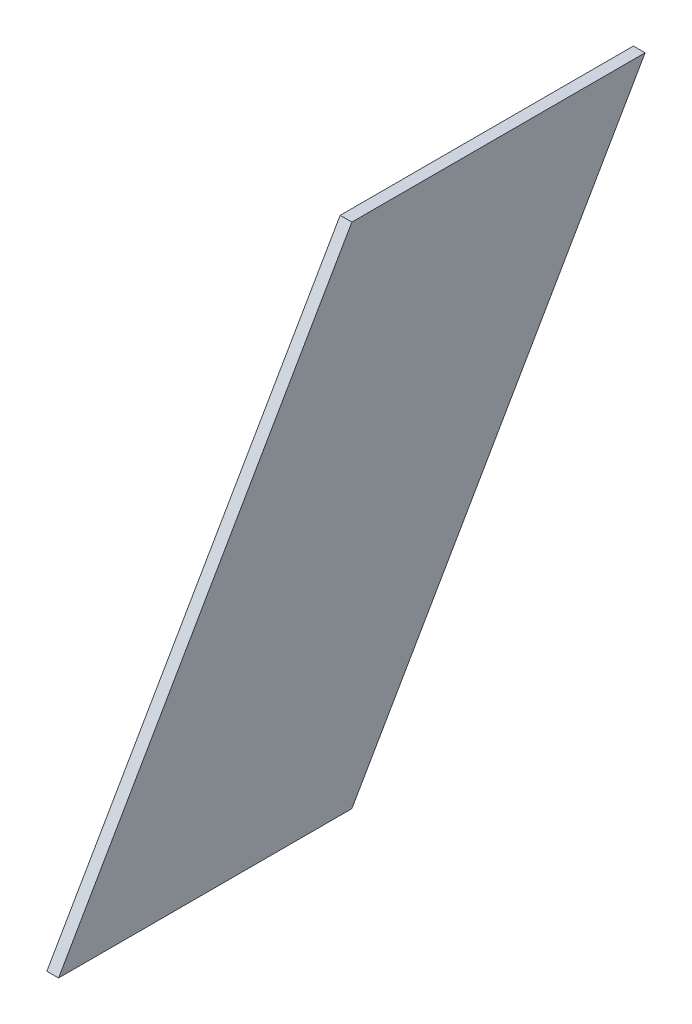
ISO-10303-21;
HEADER;
FILE_DESCRIPTION(('STEP AP214'),'2;1');
FILE_NAME('part.step','',(''),(''),'','','');
FILE_SCHEMA(('AUTOMOTIVE_DESIGN { 1 0 10303 214 1 1 1 1 }'));
ENDSEC;
DATA;
#1=APPLICATION_CONTEXT('core data for automotive mechanical design processes');
#2=APPLICATION_PROTOCOL_DEFINITION('international standard','automotive_design',2000,#1);
#3=PRODUCT_CONTEXT('',#1,'mechanical');
#4=PRODUCT('Part','Part','',(#3));
#5=PRODUCT_RELATED_PRODUCT_CATEGORY('part','',(#4));
#6=PRODUCT_DEFINITION_FORMATION('','',#4);
#7=PRODUCT_DEFINITION_CONTEXT('part definition',#1,'design');
#8=PRODUCT_DEFINITION('design','',#6,#7);
#9=PRODUCT_DEFINITION_SHAPE('','',#8);
#10=(LENGTH_UNIT() NAMED_UNIT(*) SI_UNIT(.MILLI.,.METRE.));
#11=(NAMED_UNIT(*) PLANE_ANGLE_UNIT() SI_UNIT($,.RADIAN.));
#12=(NAMED_UNIT(*) SI_UNIT($,.STERADIAN.) SOLID_ANGLE_UNIT());
#13=UNCERTAINTY_MEASURE_WITH_UNIT(LENGTH_MEASURE(1.E-05),#10,'distance_accuracy_value','');
#14=(GEOMETRIC_REPRESENTATION_CONTEXT(3) GLOBAL_UNCERTAINTY_ASSIGNED_CONTEXT((#13)) GLOBAL_UNIT_ASSIGNED_CONTEXT((#10,
#11,#12)) REPRESENTATION_CONTEXT('',''));
#15=CARTESIAN_POINT('',(0.,0.,0.));
#16=DIRECTION('',(0.,0.,1.));
#17=DIRECTION('',(1.,0.,0.));
#18=AXIS2_PLACEMENT_3D('',#15,#16,#17);
#19=CARTESIAN_POINT('',(2.,0.,0.));
#20=DIRECTION('',(0.,-0.5,-0.866025403784439));
#21=DIRECTION('',(0.,0.866025403784439,-0.5));
#22=AXIS2_PLACEMENT_3D('',#19,#20,#21);
#23=PLANE('',#22);
#24=DIRECTION('',(0.,-0.866025403784438,0.5));
#25=VECTOR('',#24,1.);
#26=CARTESIAN_POINT('',(0.,0.,0.));
#27=LINE('',#26,#25);
#28=CARTESIAN_POINT('',(0.,86.6025403784438,-50.));
#29=VERTEX_POINT('',#28);
#30=CARTESIAN_POINT('',(0.,0.,0.));
#31=VERTEX_POINT('',#30);
#32=EDGE_CURVE('E101',#29,#31,#27,.T.);
#33=ORIENTED_EDGE('',*,*,#32,.T.);
#34=DIRECTION('',(-1.,0.,0.));
#35=VECTOR('',#34,1.);
#36=CARTESIAN_POINT('',(2.,0.,0.));
#37=LINE('',#36,#35);
#38=CARTESIAN_POINT('',(2.,0.,0.));
#39=VERTEX_POINT('',#38);
#40=EDGE_CURVE('E11',#39,#31,#37,.T.);
#41=ORIENTED_EDGE('',*,*,#40,.F.);
#42=DIRECTION('',(0.,-0.866025403784438,0.5));
#43=VECTOR('',#42,1.);
#44=CARTESIAN_POINT('',(2.,0.,0.));
#45=LINE('',#44,#43);
#46=CARTESIAN_POINT('',(2.,86.6025403784438,-50.));
#47=VERTEX_POINT('',#46);
#48=EDGE_CURVE('E89',#47,#39,#45,.T.);
#49=ORIENTED_EDGE('',*,*,#48,.F.);
#50=DIRECTION('',(-1.,0.,0.));
#51=VECTOR('',#50,1.);
#52=CARTESIAN_POINT('',(2.,86.6025403784438,-50.));
#53=LINE('',#52,#51);
#54=EDGE_CURVE('E97',#47,#29,#53,.T.);
#55=ORIENTED_EDGE('',*,*,#54,.T.);
#56=EDGE_LOOP('',(#33,#41,#49,#55));
#57=FACE_BOUND('',#56,.T.);
#58=ADVANCED_FACE('F38',(#57),#23,.F.);
#59=CARTESIAN_POINT('',(2.,0.,0.));
#60=DIRECTION('',(0.,1.,0.));
#61=DIRECTION('',(0.,0.,1.));
#62=AXIS2_PLACEMENT_3D('',#59,#60,#61);
#63=PLANE('',#62);
#64=CARTESIAN_POINT('',(1.,0.,-25.));
#65=DIRECTION('',(0.,-1.,0.));
#66=DIRECTION('',(0.,0.,-1.));
#67=AXIS2_PLACEMENT_3D('',#64,#65,#66);
#68=CIRCLE('',#67,0.5);
#69=CARTESIAN_POINT('',(1.,0.,-25.5));
#70=VERTEX_POINT('',#69);
#71=EDGE_CURVE('E115',#70,#70,#68,.T.);
#72=ORIENTED_EDGE('',*,*,#71,.F.);
#73=EDGE_LOOP('',(#72));
#74=FACE_BOUND('',#73,.T.);
#75=DIRECTION('',(0.,0.,-1.));
#76=VECTOR('',#75,1.);
#77=CARTESIAN_POINT('',(0.,0.,0.));
#78=LINE('',#77,#76);
#79=CARTESIAN_POINT('',(0.,0.,-50.));
#80=VERTEX_POINT('',#79);
#81=EDGE_CURVE('E93',#31,#80,#78,.T.);
#82=ORIENTED_EDGE('',*,*,#81,.T.);
#83=DIRECTION('',(-1.,0.,0.));
#84=VECTOR('',#83,1.);
#85=CARTESIAN_POINT('',(2.,0.,-50.));
#86=LINE('',#85,#84);
#87=CARTESIAN_POINT('',(2.,0.,-50.));
#88=VERTEX_POINT('',#87);
#89=EDGE_CURVE('E46',#88,#80,#86,.T.);
#90=ORIENTED_EDGE('',*,*,#89,.F.);
#91=DIRECTION('',(0.,0.,-1.));
#92=VECTOR('',#91,1.);
#93=CARTESIAN_POINT('',(2.,0.,0.));
#94=LINE('',#93,#92);
#95=EDGE_CURVE('E84',#39,#88,#94,.T.);
#96=ORIENTED_EDGE('',*,*,#95,.F.);
#97=ORIENTED_EDGE('',*,*,#40,.T.);
#98=EDGE_LOOP('',(#82,#90,#96,#97));
#99=FACE_BOUND('',#98,.T.);
#100=ADVANCED_FACE('F92',(#74,#99),#63,.F.);
#101=CARTESIAN_POINT('',(2.,0.,-50.));
#102=DIRECTION('',(0.,0.5,0.866025403784438));
#103=DIRECTION('',(0.,-0.866025403784439,0.5));
#104=AXIS2_PLACEMENT_3D('',#101,#102,#103);
#105=PLANE('',#104);
#106=DIRECTION('',(0.,0.866025403784438,-0.5));
#107=VECTOR('',#106,1.);
#108=CARTESIAN_POINT('',(0.,0.,-50.));
#109=LINE('',#108,#107);
#110=CARTESIAN_POINT('',(0.,86.6025403784438,-100.));
#111=VERTEX_POINT('',#110);
#112=EDGE_CURVE('E71',#80,#111,#109,.T.);
#113=ORIENTED_EDGE('',*,*,#112,.T.);
#114=DIRECTION('',(-1.,0.,0.));
#115=VECTOR('',#114,1.);
#116=CARTESIAN_POINT('',(2.,86.6025403784438,-100.));
#117=LINE('',#116,#115);
#118=CARTESIAN_POINT('',(2.,86.6025403784438,-100.));
#119=VERTEX_POINT('',#118);
#120=EDGE_CURVE('E94',#119,#111,#117,.T.);
#121=ORIENTED_EDGE('',*,*,#120,.F.);
#122=DIRECTION('',(0.,0.866025403784438,-0.5));
#123=VECTOR('',#122,1.);
#124=CARTESIAN_POINT('',(2.,0.,-50.));
#125=LINE('',#124,#123);
#126=EDGE_CURVE('E87',#88,#119,#125,.T.);
#127=ORIENTED_EDGE('',*,*,#126,.F.);
#128=ORIENTED_EDGE('',*,*,#89,.T.);
#129=EDGE_LOOP('',(#113,#121,#127,#128));
#130=FACE_BOUND('',#129,.T.);
#131=ADVANCED_FACE('F95',(#130),#105,.F.);
#132=CARTESIAN_POINT('',(2.,86.6025403784438,-50.));
#133=DIRECTION('',(0.,-1.,0.));
#134=DIRECTION('',(0.,0.,-1.));
#135=AXIS2_PLACEMENT_3D('',#132,#133,#134);
#136=PLANE('',#135);
#137=DIRECTION('',(0.,0.,1.));
#138=VECTOR('',#137,1.);
#139=CARTESIAN_POINT('',(0.,86.6025403784438,-50.));
#140=LINE('',#139,#138);
#141=EDGE_CURVE('E77',#111,#29,#140,.T.);
#142=ORIENTED_EDGE('',*,*,#141,.T.);
#143=ORIENTED_EDGE('',*,*,#54,.F.);
#144=DIRECTION('',(0.,0.,1.));
#145=VECTOR('',#144,1.);
#146=CARTESIAN_POINT('',(2.,86.6025403784438,-50.));
#147=LINE('',#146,#145);
#148=EDGE_CURVE('E54',#119,#47,#147,.T.);
#149=ORIENTED_EDGE('',*,*,#148,.F.);
#150=ORIENTED_EDGE('',*,*,#120,.T.);
#151=EDGE_LOOP('',(#142,#143,#149,#150));
#152=FACE_BOUND('',#151,.T.);
#153=ADVANCED_FACE('F109',(#152),#136,.F.);
#154=CARTESIAN_POINT('',(2.,0.,0.));
#155=DIRECTION('',(-1.,0.,0.));
#156=DIRECTION('',(0.,0.,1.));
#157=AXIS2_PLACEMENT_3D('',#154,#155,#156);
#158=PLANE('',#157);
#159=ORIENTED_EDGE('',*,*,#48,.T.);
#160=ORIENTED_EDGE('',*,*,#95,.T.);
#161=ORIENTED_EDGE('',*,*,#126,.T.);
#162=ORIENTED_EDGE('',*,*,#148,.T.);
#163=EDGE_LOOP('',(#159,#160,#161,#162));
#164=FACE_BOUND('',#163,.T.);
#165=ADVANCED_FACE('F85',(#164),#158,.F.);
#166=CARTESIAN_POINT('',(0.,0.,0.));
#167=DIRECTION('',(-1.,0.,0.));
#168=DIRECTION('',(0.,0.,1.));
#169=AXIS2_PLACEMENT_3D('',#166,#167,#168);
#170=PLANE('',#169);
#171=ORIENTED_EDGE('',*,*,#32,.F.);
#172=ORIENTED_EDGE('',*,*,#141,.F.);
#173=ORIENTED_EDGE('',*,*,#112,.F.);
#174=ORIENTED_EDGE('',*,*,#81,.F.);
#175=EDGE_LOOP('',(#171,#172,#173,#174));
#176=FACE_BOUND('',#175,.T.);
#177=ADVANCED_FACE('F112',(#176),#170,.T.);
#178=CARTESIAN_POINT('',(1.,2.,-25.));
#179=DIRECTION('',(0.,-1.,0.));
#180=DIRECTION('',(0.,0.,-1.));
#181=AXIS2_PLACEMENT_3D('',#178,#179,#180);
#182=CYLINDRICAL_SURFACE('',#181,0.5);
#183=CARTESIAN_POINT('',(1.,2.,-25.));
#184=DIRECTION('',(0.,-1.,0.));
#185=DIRECTION('',(0.,0.,-1.));
#186=AXIS2_PLACEMENT_3D('',#183,#184,#185);
#187=CIRCLE('',#186,0.5);
#188=CARTESIAN_POINT('',(1.,2.,-25.5));
#189=VERTEX_POINT('',#188);
#190=EDGE_CURVE('E104',#189,#189,#187,.T.);
#191=ORIENTED_EDGE('',*,*,#190,.F.);
#192=EDGE_LOOP('',(#191));
#193=FACE_BOUND('',#192,.T.);
#194=ORIENTED_EDGE('',*,*,#71,.T.);
#195=EDGE_LOOP('',(#194));
#196=FACE_BOUND('',#195,.T.);
#197=ADVANCED_FACE('F123',(#193,#196),#182,.F.);
#198=CARTESIAN_POINT('',(1.,2.,-25.));
#199=DIRECTION('',(0.,-1.,0.));
#200=DIRECTION('',(0.,0.,-1.));
#201=AXIS2_PLACEMENT_3D('',#198,#199,#200);
#202=PLANE('',#201);
#203=ORIENTED_EDGE('',*,*,#190,.T.);
#204=EDGE_LOOP('',(#203));
#205=FACE_BOUND('',#204,.T.);
#206=ADVANCED_FACE('F121',(#205),#202,.T.);
#207=CLOSED_SHELL('',(#58,#100,#131,#153,#165,#177,#197,#206));
#208=MANIFOLD_SOLID_BREP('B2',#207);
#209=ADVANCED_BREP_SHAPE_REPRESENTATION('',(#18,#208),#14);
#210=SHAPE_DEFINITION_REPRESENTATION(#9,#209);
ENDSEC;
END-ISO-10303-21;
